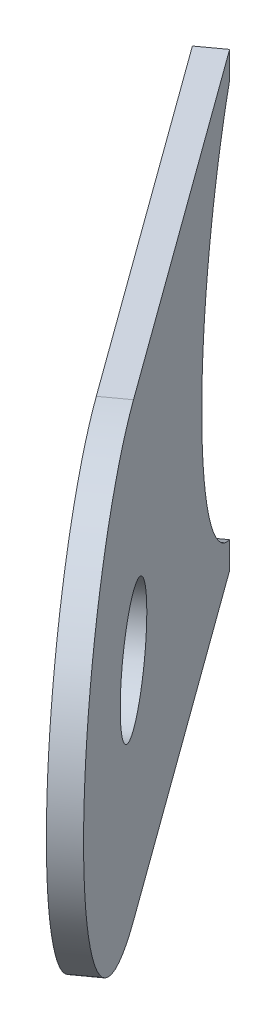
ISO-10303-21;
HEADER;
FILE_DESCRIPTION(('STEP AP214'),'2;1');
FILE_NAME('part.step','',(''),(''),'','','');
FILE_SCHEMA(('AUTOMOTIVE_DESIGN { 1 0 10303 214 1 1 1 1 }'));
ENDSEC;
DATA;
#1=APPLICATION_CONTEXT('core data for automotive mechanical design processes');
#2=APPLICATION_PROTOCOL_DEFINITION('international standard','automotive_design',2000,#1);
#3=PRODUCT_CONTEXT('',#1,'mechanical');
#4=PRODUCT('Part','Part','',(#3));
#5=PRODUCT_RELATED_PRODUCT_CATEGORY('part','',(#4));
#6=PRODUCT_DEFINITION_FORMATION('','',#4);
#7=PRODUCT_DEFINITION_CONTEXT('part definition',#1,'design');
#8=PRODUCT_DEFINITION('design','',#6,#7);
#9=PRODUCT_DEFINITION_SHAPE('','',#8);
#10=(LENGTH_UNIT() NAMED_UNIT(*) SI_UNIT(.MILLI.,.METRE.));
#11=(NAMED_UNIT(*) PLANE_ANGLE_UNIT() SI_UNIT($,.RADIAN.));
#12=(NAMED_UNIT(*) SI_UNIT($,.STERADIAN.) SOLID_ANGLE_UNIT());
#13=UNCERTAINTY_MEASURE_WITH_UNIT(LENGTH_MEASURE(1.E-05),#10,'distance_accuracy_value','');
#14=(GEOMETRIC_REPRESENTATION_CONTEXT(3) GLOBAL_UNCERTAINTY_ASSIGNED_CONTEXT((#13)) GLOBAL_UNIT_ASSIGNED_CONTEXT((#10,
#11,#12)) REPRESENTATION_CONTEXT('',''));
#15=CARTESIAN_POINT('',(0.,0.,0.));
#16=DIRECTION('',(0.,0.,1.));
#17=DIRECTION('',(1.,0.,0.));
#18=AXIS2_PLACEMENT_3D('',#15,#16,#17);
#19=CARTESIAN_POINT('',(16.3228803669011,-2.,-221.059306114371));
#20=DIRECTION('',(0.809016994374949,0.,-0.587785252292471));
#21=DIRECTION('',(-0.587785252292471,0.,-0.809016994374949));
#22=AXIS2_PLACEMENT_3D('',#19,#20,#21);
#23=ELLIPSE('',#22,13.4137196177435,12.7);
#24=DIRECTION('',(-0.809016994374949,0.,0.587785252292471));
#25=VECTOR('',#24,1.);
#26=SURFACE_OF_LINEAR_EXTRUSION('',#23,#25);
#27=CARTESIAN_POINT('',(15.1093548753387,-2.,-220.177628235932));
#28=DIRECTION('',(0.809016994374949,0.,-0.587785252292471));
#29=DIRECTION('',(-0.587785252292471,0.,-0.809016994374949));
#30=AXIS2_PLACEMENT_3D('',#27,#28,#29);
#31=ELLIPSE('',#30,13.4137196177435,12.7);
#32=CARTESIAN_POINT('',(18.8264935926878,9.19999999999997,-215.061425709489));
#33=VERTEX_POINT('',#32);
#34=CARTESIAN_POINT('',(18.8264935926878,-13.2,-215.061425709489));
#35=VERTEX_POINT('',#34);
#36=EDGE_CURVE('E123',#33,#35,#31,.T.);
#37=ORIENTED_EDGE('',*,*,#36,.F.);
#38=DIRECTION('',(-0.809016994374949,0.,0.587785252292471));
#39=VECTOR('',#38,1.);
#40=CARTESIAN_POINT('',(20.0400190842503,9.19999999999997,-215.943103587928));
#41=LINE('',#40,#39);
#42=CARTESIAN_POINT('',(20.0400190842503,9.19999999999997,-215.943103587928));
#43=VERTEX_POINT('',#42);
#44=EDGE_CURVE('E11',#43,#33,#41,.T.);
#45=ORIENTED_EDGE('',*,*,#44,.F.);
#46=CARTESIAN_POINT('',(20.0400190842503,-13.2,-215.943103587928));
#47=VERTEX_POINT('',#46);
#48=EDGE_CURVE('E139',#43,#47,#23,.T.);
#49=ORIENTED_EDGE('',*,*,#48,.T.);
#50=DIRECTION('',(-0.809016994374949,0.,0.587785252292471));
#51=VECTOR('',#50,1.);
#52=CARTESIAN_POINT('',(20.0400190842503,-13.2,-215.943103587928));
#53=LINE('',#52,#51);
#54=EDGE_CURVE('E81',#47,#35,#53,.T.);
#55=ORIENTED_EDGE('',*,*,#54,.T.);
#56=EDGE_LOOP('',(#37,#45,#49,#55));
#57=FACE_BOUND('',#56,.T.);
#58=ADVANCED_FACE('F36',(#57),#26,.T.);
#59=CARTESIAN_POINT('',(20.0400190842503,0.,-215.943103587928));
#60=DIRECTION('',(-0.587785252292471,0.,-0.809016994374949));
#61=DIRECTION('',(-0.809016994374949,0.,0.587785252292471));
#62=AXIS2_PLACEMENT_3D('',#59,#60,#61);
#63=PLANE('',#62);
#64=DIRECTION('',(0.,-1.,0.));
#65=VECTOR('',#64,1.);
#66=CARTESIAN_POINT('',(18.8264935926878,0.,-215.061425709489));
#67=LINE('',#66,#65);
#68=CARTESIAN_POINT('',(18.8264935926878,10.7,-215.061425709489));
#69=VERTEX_POINT('',#68);
#70=EDGE_CURVE('E126',#69,#33,#67,.T.);
#71=ORIENTED_EDGE('',*,*,#70,.F.);
#72=DIRECTION('',(-0.809016994374949,0.,0.587785252292471));
#73=VECTOR('',#72,1.);
#74=CARTESIAN_POINT('',(20.0400190842503,10.7,-215.943103587928));
#75=LINE('',#74,#73);
#76=CARTESIAN_POINT('',(20.0400190842503,10.7,-215.943103587928));
#77=VERTEX_POINT('',#76);
#78=EDGE_CURVE('E45',#77,#69,#75,.T.);
#79=ORIENTED_EDGE('',*,*,#78,.F.);
#80=DIRECTION('',(0.,-1.,0.));
#81=VECTOR('',#80,1.);
#82=CARTESIAN_POINT('',(20.0400190842503,0.,-215.943103587928));
#83=LINE('',#82,#81);
#84=EDGE_CURVE('E152',#77,#43,#83,.T.);
#85=ORIENTED_EDGE('',*,*,#84,.T.);
#86=ORIENTED_EDGE('',*,*,#44,.T.);
#87=EDGE_LOOP('',(#71,#79,#85,#86));
#88=FACE_BOUND('',#87,.T.);
#89=ADVANCED_FACE('F151',(#88),#63,.T.);
#90=CARTESIAN_POINT('',(115.80341068259,10.7,-84.1361027489715));
#91=DIRECTION('',(0.,-1.,0.));
#92=DIRECTION('',(1.,0.,0.));
#93=AXIS2_PLACEMENT_3D('',#90,#91,#92);
#94=PLANE('',#93);
#95=DIRECTION('',(0.587785252292471,0.,0.809016994374949));
#96=VECTOR('',#95,1.);
#97=CARTESIAN_POINT('',(114.589885191027,10.7,-83.2544248705328));
#98=LINE('',#97,#96);
#99=CARTESIAN_POINT('',(33.1997273269524,10.7,-195.278366658941));
#100=VERTEX_POINT('',#99);
#101=EDGE_CURVE('E129',#69,#100,#98,.T.);
#102=ORIENTED_EDGE('',*,*,#101,.T.);
#103=DIRECTION('',(-0.809016994374949,0.,0.587785252292471));
#104=VECTOR('',#103,1.);
#105=CARTESIAN_POINT('',(34.4132528185148,10.7,-196.16004453738));
#106=LINE('',#105,#104);
#107=CARTESIAN_POINT('',(34.4132528185148,10.7,-196.16004453738));
#108=VERTEX_POINT('',#107);
#109=EDGE_CURVE('E113',#108,#100,#106,.T.);
#110=ORIENTED_EDGE('',*,*,#109,.F.);
#111=DIRECTION('',(0.587785252292471,0.,0.809016994374949));
#112=VECTOR('',#111,1.);
#113=CARTESIAN_POINT('',(115.80341068259,10.7,-84.1361027489715));
#114=LINE('',#113,#112);
#115=EDGE_CURVE('E100',#77,#108,#114,.T.);
#116=ORIENTED_EDGE('',*,*,#115,.F.);
#117=ORIENTED_EDGE('',*,*,#78,.T.);
#118=EDGE_LOOP('',(#102,#110,#116,#117));
#119=FACE_BOUND('',#118,.T.);
#120=ADVANCED_FACE('F144',(#119),#94,.F.);
#121=CARTESIAN_POINT('',(34.4132528185148,-2.,-196.16004453738));
#122=DIRECTION('',(-0.809016994374949,0.,0.587785252292471));
#123=DIRECTION('',(0.587785252292471,0.,0.809016994374949));
#124=AXIS2_PLACEMENT_3D('',#121,#122,#123);
#125=CYLINDRICAL_SURFACE('',#124,12.7);
#126=CARTESIAN_POINT('',(33.1997273269524,-2.,-195.278366658941));
#127=DIRECTION('',(0.809016994374949,0.,-0.587785252292471));
#128=DIRECTION('',(-0.587785252292471,0.,-0.809016994374949));
#129=AXIS2_PLACEMENT_3D('',#126,#127,#128);
#130=CIRCLE('',#129,12.7);
#131=CARTESIAN_POINT('',(33.1997273269524,-14.7,-195.278366658941));
#132=VERTEX_POINT('',#131);
#133=EDGE_CURVE('E109',#100,#132,#130,.T.);
#134=ORIENTED_EDGE('',*,*,#133,.T.);
#135=DIRECTION('',(-0.809016994374949,0.,0.587785252292471));
#136=VECTOR('',#135,1.);
#137=CARTESIAN_POINT('',(34.4132528185148,-14.7,-196.16004453738));
#138=LINE('',#137,#136);
#139=CARTESIAN_POINT('',(34.4132528185148,-14.7,-196.16004453738));
#140=VERTEX_POINT('',#139);
#141=EDGE_CURVE('E106',#140,#132,#138,.T.);
#142=ORIENTED_EDGE('',*,*,#141,.F.);
#143=CARTESIAN_POINT('',(34.4132528185148,-2.,-196.16004453738));
#144=DIRECTION('',(0.809016994374949,0.,-0.587785252292471));
#145=DIRECTION('',(-0.587785252292471,0.,-0.809016994374949));
#146=AXIS2_PLACEMENT_3D('',#143,#144,#145);
#147=CIRCLE('',#146,12.7);
#148=EDGE_CURVE('E92',#108,#140,#147,.T.);
#149=ORIENTED_EDGE('',*,*,#148,.F.);
#150=ORIENTED_EDGE('',*,*,#109,.T.);
#151=EDGE_LOOP('',(#134,#142,#149,#150));
#152=FACE_BOUND('',#151,.T.);
#153=ADVANCED_FACE('F107',(#152),#125,.T.);
#154=CARTESIAN_POINT('',(115.80341068259,-14.7,-84.1361027489715));
#155=DIRECTION('',(0.,-1.,0.));
#156=DIRECTION('',(1.,0.,0.));
#157=AXIS2_PLACEMENT_3D('',#154,#155,#156);
#158=PLANE('',#157);
#159=DIRECTION('',(0.587785252292471,0.,0.809016994374949));
#160=VECTOR('',#159,1.);
#161=CARTESIAN_POINT('',(114.589885191027,-14.7,-83.2544248705328));
#162=LINE('',#161,#160);
#163=CARTESIAN_POINT('',(18.8264935926878,-14.7,-215.061425709489));
#164=VERTEX_POINT('',#163);
#165=EDGE_CURVE('E132',#164,#132,#162,.T.);
#166=ORIENTED_EDGE('',*,*,#165,.F.);
#167=DIRECTION('',(-0.809016994374949,0.,0.587785252292471));
#168=VECTOR('',#167,1.);
#169=CARTESIAN_POINT('',(20.0400190842503,-14.7,-215.943103587928));
#170=LINE('',#169,#168);
#171=CARTESIAN_POINT('',(20.0400190842503,-14.7,-215.943103587928));
#172=VERTEX_POINT('',#171);
#173=EDGE_CURVE('E74',#172,#164,#170,.T.);
#174=ORIENTED_EDGE('',*,*,#173,.F.);
#175=DIRECTION('',(0.587785252292471,0.,0.809016994374949));
#176=VECTOR('',#175,1.);
#177=CARTESIAN_POINT('',(115.80341068259,-14.7,-84.1361027489715));
#178=LINE('',#177,#176);
#179=EDGE_CURVE('E97',#172,#140,#178,.T.);
#180=ORIENTED_EDGE('',*,*,#179,.T.);
#181=ORIENTED_EDGE('',*,*,#141,.T.);
#182=EDGE_LOOP('',(#166,#174,#180,#181));
#183=FACE_BOUND('',#182,.T.);
#184=ADVANCED_FACE('F115',(#183),#158,.T.);
#185=CARTESIAN_POINT('',(20.0400190842503,0.,-215.943103587928));
#186=DIRECTION('',(0.587785252292471,0.,0.809016994374949));
#187=DIRECTION('',(0.809016994374949,0.,-0.587785252292471));
#188=AXIS2_PLACEMENT_3D('',#185,#186,#187);
#189=PLANE('',#188);
#190=DIRECTION('',(0.,1.,0.));
#191=VECTOR('',#190,1.);
#192=CARTESIAN_POINT('',(18.8264935926878,0.,-215.061425709489));
#193=LINE('',#192,#191);
#194=EDGE_CURVE('E134',#164,#35,#193,.T.);
#195=ORIENTED_EDGE('',*,*,#194,.T.);
#196=ORIENTED_EDGE('',*,*,#54,.F.);
#197=DIRECTION('',(0.,1.,0.));
#198=VECTOR('',#197,1.);
#199=CARTESIAN_POINT('',(20.0400190842503,0.,-215.943103587928));
#200=LINE('',#199,#198);
#201=EDGE_CURVE('E53',#172,#47,#200,.T.);
#202=ORIENTED_EDGE('',*,*,#201,.F.);
#203=ORIENTED_EDGE('',*,*,#173,.T.);
#204=EDGE_LOOP('',(#195,#196,#202,#203));
#205=FACE_BOUND('',#204,.T.);
#206=ADVANCED_FACE('F153',(#205),#189,.F.);
#207=CARTESIAN_POINT('',(34.4132528185148,-2.,-196.16004453738));
#208=DIRECTION('',(-0.809016994374949,0.,0.587785252292471));
#209=DIRECTION('',(0.587785252292471,0.,0.809016994374949));
#210=AXIS2_PLACEMENT_3D('',#207,#208,#209);
#211=CYLINDRICAL_SURFACE('',#210,3.37819999999998);
#212=CARTESIAN_POINT('',(34.4132528185148,-2.,-196.16004453738));
#213=DIRECTION('',(0.809016994374949,0.,-0.587785252292471));
#214=DIRECTION('',(-0.587785252292471,0.,-0.809016994374949));
#215=AXIS2_PLACEMENT_3D('',#212,#213,#214);
#216=CIRCLE('',#215,3.37819999999998);
#217=CARTESIAN_POINT('',(32.4275966792204,-2.,-198.893065747777));
#218=VERTEX_POINT('',#217);
#219=EDGE_CURVE('E117',#218,#218,#216,.T.);
#220=ORIENTED_EDGE('',*,*,#219,.T.);
#221=EDGE_LOOP('',(#220));
#222=FACE_BOUND('',#221,.T.);
#223=CARTESIAN_POINT('',(33.1997273269524,-2.,-195.278366658941));
#224=DIRECTION('',(0.809016994374949,0.,-0.587785252292471));
#225=DIRECTION('',(-0.587785252292471,0.,-0.809016994374949));
#226=AXIS2_PLACEMENT_3D('',#223,#224,#225);
#227=CIRCLE('',#226,3.37819999999998);
#228=CARTESIAN_POINT('',(31.214071187658,-2.,-198.011387869338));
#229=VERTEX_POINT('',#228);
#230=EDGE_CURVE('E136',#229,#229,#227,.T.);
#231=ORIENTED_EDGE('',*,*,#230,.F.);
#232=EDGE_LOOP('',(#231));
#233=FACE_BOUND('',#232,.T.);
#234=ADVANCED_FACE('F157',(#222,#233),#211,.F.);
#235=CARTESIAN_POINT('',(115.80341068259,0.,-84.1361027489715));
#236=DIRECTION('',(0.809016994374949,0.,-0.587785252292471));
#237=DIRECTION('',(-0.587785252292471,0.,-0.809016994374949));
#238=AXIS2_PLACEMENT_3D('',#235,#236,#237);
#239=PLANE('',#238);
#240=ORIENTED_EDGE('',*,*,#48,.F.);
#241=ORIENTED_EDGE('',*,*,#84,.F.);
#242=ORIENTED_EDGE('',*,*,#115,.T.);
#243=ORIENTED_EDGE('',*,*,#148,.T.);
#244=ORIENTED_EDGE('',*,*,#179,.F.);
#245=ORIENTED_EDGE('',*,*,#201,.T.);
#246=EDGE_LOOP('',(#240,#241,#242,#243,#244,#245));
#247=FACE_BOUND('',#246,.T.);
#248=ORIENTED_EDGE('',*,*,#219,.F.);
#249=EDGE_LOOP('',(#248));
#250=FACE_BOUND('',#249,.T.);
#251=ADVANCED_FACE('F94',(#247,#250),#239,.T.);
#252=CARTESIAN_POINT('',(114.589885191027,0.,-83.2544248705328));
#253=DIRECTION('',(0.809016994374949,0.,-0.587785252292471));
#254=DIRECTION('',(-0.587785252292471,0.,-0.809016994374949));
#255=AXIS2_PLACEMENT_3D('',#252,#253,#254);
#256=PLANE('',#255);
#257=ORIENTED_EDGE('',*,*,#36,.T.);
#258=ORIENTED_EDGE('',*,*,#194,.F.);
#259=ORIENTED_EDGE('',*,*,#165,.T.);
#260=ORIENTED_EDGE('',*,*,#133,.F.);
#261=ORIENTED_EDGE('',*,*,#101,.F.);
#262=ORIENTED_EDGE('',*,*,#70,.T.);
#263=EDGE_LOOP('',(#257,#258,#259,#260,#261,#262));
#264=FACE_BOUND('',#263,.T.);
#265=ORIENTED_EDGE('',*,*,#230,.T.);
#266=EDGE_LOOP('',(#265));
#267=FACE_BOUND('',#266,.T.);
#268=ADVANCED_FACE('F149',(#264,#267),#256,.F.);
#269=CLOSED_SHELL('',(#58,#89,#120,#153,#184,#206,#234,#251,#268));
#270=MANIFOLD_SOLID_BREP('B2',#269);
#271=ADVANCED_BREP_SHAPE_REPRESENTATION('',(#18,#270),#14);
#272=SHAPE_DEFINITION_REPRESENTATION(#9,#271);
ENDSEC;
END-ISO-10303-21;
